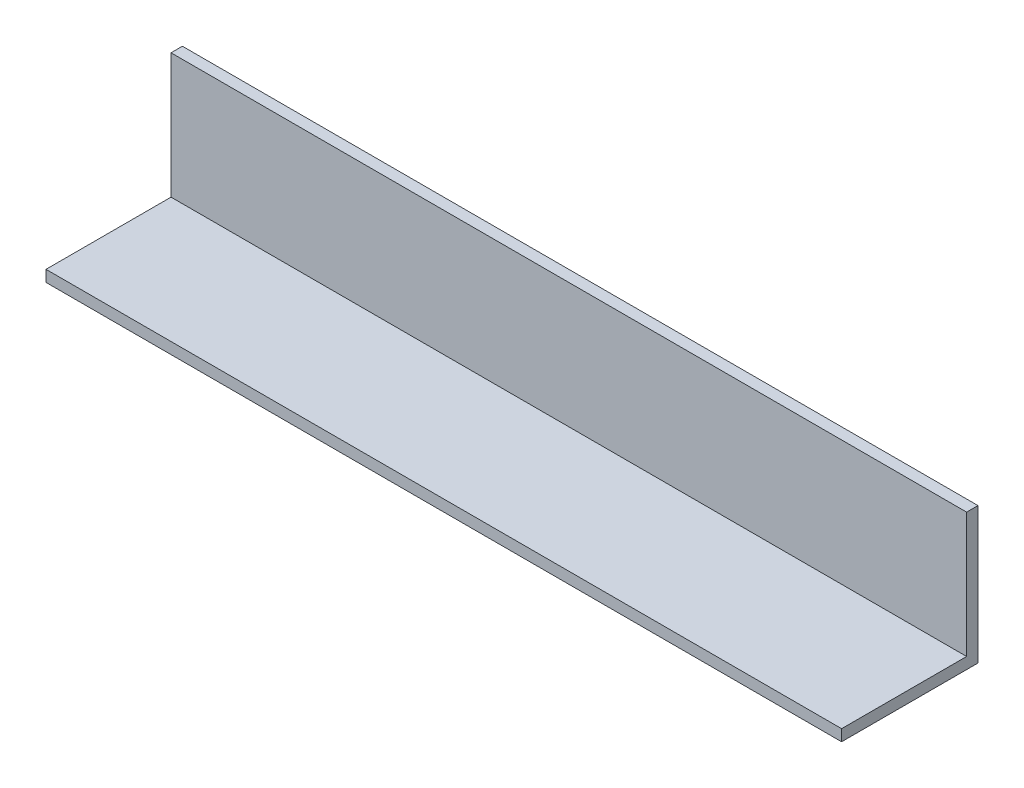
ISO-10303-21;
HEADER;
FILE_DESCRIPTION(('STEP AP214'),'2;1');
FILE_NAME('part.step','',(''),(''),'','','');
FILE_SCHEMA(('AUTOMOTIVE_DESIGN { 1 0 10303 214 1 1 1 1 }'));
ENDSEC;
DATA;
#1=APPLICATION_CONTEXT('core data for automotive mechanical design processes');
#2=APPLICATION_PROTOCOL_DEFINITION('international standard','automotive_design',2000,#1);
#3=PRODUCT_CONTEXT('',#1,'mechanical');
#4=PRODUCT('Part','Part','',(#3));
#5=PRODUCT_RELATED_PRODUCT_CATEGORY('part','',(#4));
#6=PRODUCT_DEFINITION_FORMATION('','',#4);
#7=PRODUCT_DEFINITION_CONTEXT('part definition',#1,'design');
#8=PRODUCT_DEFINITION('design','',#6,#7);
#9=PRODUCT_DEFINITION_SHAPE('','',#8);
#10=(LENGTH_UNIT() NAMED_UNIT(*) SI_UNIT(.MILLI.,.METRE.));
#11=(NAMED_UNIT(*) PLANE_ANGLE_UNIT() SI_UNIT($,.RADIAN.));
#12=(NAMED_UNIT(*) SI_UNIT($,.STERADIAN.) SOLID_ANGLE_UNIT());
#13=UNCERTAINTY_MEASURE_WITH_UNIT(LENGTH_MEASURE(1.E-05),#10,'distance_accuracy_value','');
#14=(GEOMETRIC_REPRESENTATION_CONTEXT(3) GLOBAL_UNCERTAINTY_ASSIGNED_CONTEXT((#13)) GLOBAL_UNIT_ASSIGNED_CONTEXT((#10,
#11,#12)) REPRESENTATION_CONTEXT('',''));
#15=CARTESIAN_POINT('',(0.,0.,0.));
#16=DIRECTION('',(0.,0.,1.));
#17=DIRECTION('',(1.,0.,0.));
#18=AXIS2_PLACEMENT_3D('',#15,#16,#17);
#19=CARTESIAN_POINT('',(-36.8128378378378,22.645472972973,38.1));
#20=DIRECTION('',(0.,-1.,0.));
#21=DIRECTION('',(0.,0.,-1.));
#22=AXIS2_PLACEMENT_3D('',#19,#20,#21);
#23=PLANE('',#22);
#24=DIRECTION('',(-1.,0.,0.));
#25=VECTOR('',#24,1.);
#26=CARTESIAN_POINT('',(-36.8128378378378,22.645472972973,3.175));
#27=LINE('',#26,#25);
#28=CARTESIAN_POINT('',(185.437162162162,22.645472972973,3.175));
#29=VERTEX_POINT('',#28);
#30=CARTESIAN_POINT('',(-36.8128378378378,22.645472972973,3.175));
#31=VERTEX_POINT('',#30);
#32=EDGE_CURVE('E138',#29,#31,#27,.T.);
#33=ORIENTED_EDGE('',*,*,#32,.F.);
#34=DIRECTION('',(0.,0.,-1.));
#35=VECTOR('',#34,1.);
#36=CARTESIAN_POINT('',(185.437162162162,22.645472972973,38.1));
#37=LINE('',#36,#35);
#38=CARTESIAN_POINT('',(185.437162162162,22.645472972973,0.));
#39=VERTEX_POINT('',#38);
#40=EDGE_CURVE('E95',#29,#39,#37,.T.);
#41=ORIENTED_EDGE('',*,*,#40,.T.);
#42=DIRECTION('',(-1.,0.,0.));
#43=VECTOR('',#42,1.);
#44=CARTESIAN_POINT('',(-36.8128378378378,22.645472972973,0.));
#45=LINE('',#44,#43);
#46=CARTESIAN_POINT('',(-36.8128378378378,22.645472972973,0.));
#47=VERTEX_POINT('',#46);
#48=EDGE_CURVE('E99',#39,#47,#45,.T.);
#49=ORIENTED_EDGE('',*,*,#48,.T.);
#50=DIRECTION('',(0.,0.,-1.));
#51=VECTOR('',#50,1.);
#52=CARTESIAN_POINT('',(-36.8128378378378,22.645472972973,38.1));
#53=LINE('',#52,#51);
#54=EDGE_CURVE('E84',#31,#47,#53,.T.);
#55=ORIENTED_EDGE('',*,*,#54,.F.);
#56=EDGE_LOOP('',(#33,#41,#49,#55));
#57=FACE_BOUND('',#56,.T.);
#58=ADVANCED_FACE('F39',(#57),#23,.F.);
#59=CARTESIAN_POINT('',(-36.8128378378378,22.645472972973,38.1));
#60=DIRECTION('',(1.,0.,0.));
#61=DIRECTION('',(0.,1.,0.));
#62=AXIS2_PLACEMENT_3D('',#59,#60,#61);
#63=PLANE('',#62);
#64=DIRECTION('',(0.,-1.,0.));
#65=VECTOR('',#64,1.);
#66=CARTESIAN_POINT('',(-36.8128378378378,22.645472972973,38.1));
#67=LINE('',#66,#65);
#68=CARTESIAN_POINT('',(-36.8128378378378,-12.279527027027,38.1));
#69=VERTEX_POINT('',#68);
#70=CARTESIAN_POINT('',(-36.8128378378378,-15.454527027027,38.1));
#71=VERTEX_POINT('',#70);
#72=EDGE_CURVE('E105',#69,#71,#67,.T.);
#73=ORIENTED_EDGE('',*,*,#72,.F.);
#74=DIRECTION('',(0.,0.,1.));
#75=VECTOR('',#74,1.);
#76=CARTESIAN_POINT('',(-36.8128378378378,-12.279527027027,3.175));
#77=LINE('',#76,#75);
#78=CARTESIAN_POINT('',(-36.8128378378378,-12.279527027027,3.175));
#79=VERTEX_POINT('',#78);
#80=EDGE_CURVE('E55',#79,#69,#77,.T.);
#81=ORIENTED_EDGE('',*,*,#80,.F.);
#82=DIRECTION('',(0.,-1.,0.));
#83=VECTOR('',#82,1.);
#84=CARTESIAN_POINT('',(-36.8128378378378,22.645472972973,3.175));
#85=LINE('',#84,#83);
#86=EDGE_CURVE('E91',#31,#79,#85,.T.);
#87=ORIENTED_EDGE('',*,*,#86,.F.);
#88=ORIENTED_EDGE('',*,*,#54,.T.);
#89=DIRECTION('',(0.,-1.,0.));
#90=VECTOR('',#89,1.);
#91=CARTESIAN_POINT('',(-36.8128378378378,22.645472972973,0.));
#92=LINE('',#91,#90);
#93=CARTESIAN_POINT('',(-36.8128378378378,-15.454527027027,0.));
#94=VERTEX_POINT('',#93);
#95=EDGE_CURVE('E89',#47,#94,#92,.T.);
#96=ORIENTED_EDGE('',*,*,#95,.T.);
#97=DIRECTION('',(0.,0.,-1.));
#98=VECTOR('',#97,1.);
#99=CARTESIAN_POINT('',(-36.8128378378378,-15.454527027027,38.1));
#100=LINE('',#99,#98);
#101=EDGE_CURVE('E11',#71,#94,#100,.T.);
#102=ORIENTED_EDGE('',*,*,#101,.F.);
#103=EDGE_LOOP('',(#73,#81,#87,#88,#96,#102));
#104=FACE_BOUND('',#103,.T.);
#105=ADVANCED_FACE('F41',(#104),#63,.F.);
#106=CARTESIAN_POINT('',(-36.8128378378378,-15.454527027027,38.1));
#107=DIRECTION('',(0.,1.,0.));
#108=DIRECTION('',(0.,0.,1.));
#109=AXIS2_PLACEMENT_3D('',#106,#107,#108);
#110=PLANE('',#109);
#111=DIRECTION('',(1.,0.,0.));
#112=VECTOR('',#111,1.);
#113=CARTESIAN_POINT('',(-36.8128378378378,-15.454527027027,0.));
#114=LINE('',#113,#112);
#115=CARTESIAN_POINT('',(185.437162162162,-15.454527027027,0.));
#116=VERTEX_POINT('',#115);
#117=EDGE_CURVE('E109',#94,#116,#114,.T.);
#118=ORIENTED_EDGE('',*,*,#117,.T.);
#119=DIRECTION('',(0.,0.,-1.));
#120=VECTOR('',#119,1.);
#121=CARTESIAN_POINT('',(185.437162162162,-15.454527027027,38.1));
#122=LINE('',#121,#120);
#123=CARTESIAN_POINT('',(185.437162162162,-15.454527027027,38.1));
#124=VERTEX_POINT('',#123);
#125=EDGE_CURVE('E48',#124,#116,#122,.T.);
#126=ORIENTED_EDGE('',*,*,#125,.F.);
#127=DIRECTION('',(1.,0.,0.));
#128=VECTOR('',#127,1.);
#129=CARTESIAN_POINT('',(-36.8128378378378,-15.454527027027,38.1));
#130=LINE('',#129,#128);
#131=EDGE_CURVE('E64',#71,#124,#130,.T.);
#132=ORIENTED_EDGE('',*,*,#131,.F.);
#133=ORIENTED_EDGE('',*,*,#101,.T.);
#134=EDGE_LOOP('',(#118,#126,#132,#133));
#135=FACE_BOUND('',#134,.T.);
#136=ADVANCED_FACE('F131',(#135),#110,.F.);
#137=CARTESIAN_POINT('',(185.437162162162,22.645472972973,38.1));
#138=DIRECTION('',(-1.,0.,0.));
#139=DIRECTION('',(0.,0.,1.));
#140=AXIS2_PLACEMENT_3D('',#137,#138,#139);
#141=PLANE('',#140);
#142=DIRECTION('',(0.,1.,0.));
#143=VECTOR('',#142,1.);
#144=CARTESIAN_POINT('',(185.437162162162,22.645472972973,3.175));
#145=LINE('',#144,#143);
#146=CARTESIAN_POINT('',(185.437162162162,-12.279527027027,3.175));
#147=VERTEX_POINT('',#146);
#148=EDGE_CURVE('E146',#147,#29,#145,.T.);
#149=ORIENTED_EDGE('',*,*,#148,.F.);
#150=DIRECTION('',(0.,0.,1.));
#151=VECTOR('',#150,1.);
#152=CARTESIAN_POINT('',(185.437162162162,-12.279527027027,3.175));
#153=LINE('',#152,#151);
#154=CARTESIAN_POINT('',(185.437162162162,-12.279527027027,38.1));
#155=VERTEX_POINT('',#154);
#156=EDGE_CURVE('E111',#147,#155,#153,.T.);
#157=ORIENTED_EDGE('',*,*,#156,.T.);
#158=DIRECTION('',(0.,1.,0.));
#159=VECTOR('',#158,1.);
#160=CARTESIAN_POINT('',(185.437162162162,22.645472972973,38.1));
#161=LINE('',#160,#159);
#162=EDGE_CURVE('E96',#124,#155,#161,.T.);
#163=ORIENTED_EDGE('',*,*,#162,.F.);
#164=ORIENTED_EDGE('',*,*,#125,.T.);
#165=DIRECTION('',(0.,1.,0.));
#166=VECTOR('',#165,1.);
#167=CARTESIAN_POINT('',(185.437162162162,22.645472972973,0.));
#168=LINE('',#167,#166);
#169=EDGE_CURVE('E106',#116,#39,#168,.T.);
#170=ORIENTED_EDGE('',*,*,#169,.T.);
#171=ORIENTED_EDGE('',*,*,#40,.F.);
#172=EDGE_LOOP('',(#149,#157,#163,#164,#170,#171));
#173=FACE_BOUND('',#172,.T.);
#174=ADVANCED_FACE('F129',(#173),#141,.F.);
#175=CARTESIAN_POINT('',(0.,0.,38.1));
#176=DIRECTION('',(0.,0.,1.));
#177=DIRECTION('',(1.,0.,0.));
#178=AXIS2_PLACEMENT_3D('',#175,#176,#177);
#179=PLANE('',#178);
#180=DIRECTION('',(1.,0.,0.));
#181=VECTOR('',#180,1.);
#182=CARTESIAN_POINT('',(-36.8128378378378,-12.279527027027,38.1));
#183=LINE('',#182,#181);
#184=EDGE_CURVE('E140',#69,#155,#183,.T.);
#185=ORIENTED_EDGE('',*,*,#184,.F.);
#186=ORIENTED_EDGE('',*,*,#72,.T.);
#187=ORIENTED_EDGE('',*,*,#131,.T.);
#188=ORIENTED_EDGE('',*,*,#162,.T.);
#189=EDGE_LOOP('',(#185,#186,#187,#188));
#190=FACE_BOUND('',#189,.T.);
#191=ADVANCED_FACE('F165',(#190),#179,.T.);
#192=CARTESIAN_POINT('',(0.,0.,0.));
#193=DIRECTION('',(0.,0.,1.));
#194=DIRECTION('',(1.,0.,0.));
#195=AXIS2_PLACEMENT_3D('',#192,#193,#194);
#196=PLANE('',#195);
#197=ORIENTED_EDGE('',*,*,#95,.F.);
#198=ORIENTED_EDGE('',*,*,#48,.F.);
#199=ORIENTED_EDGE('',*,*,#169,.F.);
#200=ORIENTED_EDGE('',*,*,#117,.F.);
#201=EDGE_LOOP('',(#197,#198,#199,#200));
#202=FACE_BOUND('',#201,.T.);
#203=ADVANCED_FACE('F108',(#202),#196,.F.);
#204=CARTESIAN_POINT('',(-36.8128378378378,-12.279527027027,3.175));
#205=DIRECTION('',(0.,-1.,0.));
#206=DIRECTION('',(0.,0.,-1.));
#207=AXIS2_PLACEMENT_3D('',#204,#205,#206);
#208=PLANE('',#207);
#209=ORIENTED_EDGE('',*,*,#184,.T.);
#210=ORIENTED_EDGE('',*,*,#156,.F.);
#211=DIRECTION('',(1.,0.,0.));
#212=VECTOR('',#211,1.);
#213=CARTESIAN_POINT('',(-36.8128378378378,-12.279527027027,3.175));
#214=LINE('',#213,#212);
#215=EDGE_CURVE('E150',#79,#147,#214,.T.);
#216=ORIENTED_EDGE('',*,*,#215,.F.);
#217=ORIENTED_EDGE('',*,*,#80,.T.);
#218=EDGE_LOOP('',(#209,#210,#216,#217));
#219=FACE_BOUND('',#218,.T.);
#220=ADVANCED_FACE('F167',(#219),#208,.F.);
#221=CARTESIAN_POINT('',(0.,0.,3.175));
#222=DIRECTION('',(0.,0.,1.));
#223=DIRECTION('',(1.,0.,0.));
#224=AXIS2_PLACEMENT_3D('',#221,#222,#223);
#225=PLANE('',#224);
#226=ORIENTED_EDGE('',*,*,#86,.T.);
#227=ORIENTED_EDGE('',*,*,#215,.T.);
#228=ORIENTED_EDGE('',*,*,#148,.T.);
#229=ORIENTED_EDGE('',*,*,#32,.T.);
#230=EDGE_LOOP('',(#226,#227,#228,#229));
#231=FACE_BOUND('',#230,.T.);
#232=ADVANCED_FACE('F156',(#231),#225,.T.);
#233=CLOSED_SHELL('',(#58,#105,#136,#174,#191,#203,#220,#232));
#234=MANIFOLD_SOLID_BREP('B2',#233);
#235=ADVANCED_BREP_SHAPE_REPRESENTATION('',(#18,#234),#14);
#236=SHAPE_DEFINITION_REPRESENTATION(#9,#235);
ENDSEC;
END-ISO-10303-21;
